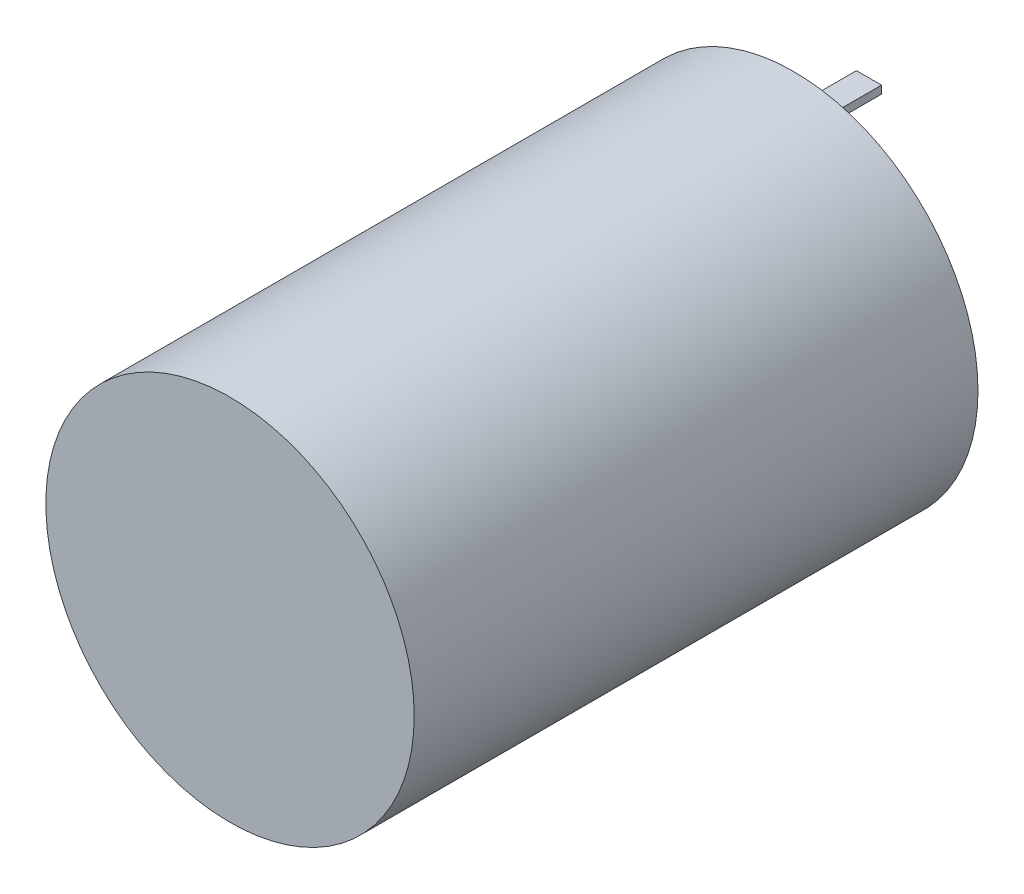
ISO-10303-21;
HEADER;
FILE_DESCRIPTION(('STEP AP214'),'2;1');
FILE_NAME('part.step','',(''),(''),'','','');
FILE_SCHEMA(('AUTOMOTIVE_DESIGN { 1 0 10303 214 1 1 1 1 }'));
ENDSEC;
DATA;
#1=APPLICATION_CONTEXT('core data for automotive mechanical design processes');
#2=APPLICATION_PROTOCOL_DEFINITION('international standard','automotive_design',2000,#1);
#3=PRODUCT_CONTEXT('',#1,'mechanical');
#4=PRODUCT('Part','Part','',(#3));
#5=PRODUCT_RELATED_PRODUCT_CATEGORY('part','',(#4));
#6=PRODUCT_DEFINITION_FORMATION('','',#4);
#7=PRODUCT_DEFINITION_CONTEXT('part definition',#1,'design');
#8=PRODUCT_DEFINITION('design','',#6,#7);
#9=PRODUCT_DEFINITION_SHAPE('','',#8);
#10=(LENGTH_UNIT() NAMED_UNIT(*) SI_UNIT(.MILLI.,.METRE.));
#11=(NAMED_UNIT(*) PLANE_ANGLE_UNIT() SI_UNIT($,.RADIAN.));
#12=(NAMED_UNIT(*) SI_UNIT($,.STERADIAN.) SOLID_ANGLE_UNIT());
#13=UNCERTAINTY_MEASURE_WITH_UNIT(LENGTH_MEASURE(1.E-05),#10,'distance_accuracy_value','');
#14=(GEOMETRIC_REPRESENTATION_CONTEXT(3) GLOBAL_UNCERTAINTY_ASSIGNED_CONTEXT((#13)) GLOBAL_UNIT_ASSIGNED_CONTEXT((#10,
#11,#12)) REPRESENTATION_CONTEXT('',''));
#15=CARTESIAN_POINT('',(0.,0.,0.));
#16=DIRECTION('',(0.,0.,1.));
#17=DIRECTION('',(1.,0.,0.));
#18=AXIS2_PLACEMENT_3D('',#15,#16,#17);
#19=CARTESIAN_POINT('',(0.,0.,57.15));
#20=DIRECTION('',(0.,0.,-1.));
#21=DIRECTION('',(-1.,0.,0.));
#22=AXIS2_PLACEMENT_3D('',#19,#20,#21);
#23=CYLINDRICAL_SURFACE('',#22,18.669);
#24=CARTESIAN_POINT('',(0.,0.,57.15));
#25=DIRECTION('',(0.,0.,1.));
#26=DIRECTION('',(1.,0.,0.));
#27=AXIS2_PLACEMENT_3D('',#24,#25,#26);
#28=CIRCLE('',#27,18.669);
#29=CARTESIAN_POINT('',(18.669,0.,57.15));
#30=VERTEX_POINT('',#29);
#31=EDGE_CURVE('E11',#30,#30,#28,.T.);
#32=ORIENTED_EDGE('',*,*,#31,.F.);
#33=EDGE_LOOP('',(#32));
#34=FACE_BOUND('',#33,.T.);
#35=CARTESIAN_POINT('',(0.,0.,0.));
#36=DIRECTION('',(0.,0.,1.));
#37=DIRECTION('',(1.,0.,0.));
#38=AXIS2_PLACEMENT_3D('',#35,#36,#37);
#39=CIRCLE('',#38,18.669);
#40=CARTESIAN_POINT('',(18.669,0.,0.));
#41=VERTEX_POINT('',#40);
#42=EDGE_CURVE('E37',#41,#41,#39,.T.);
#43=ORIENTED_EDGE('',*,*,#42,.T.);
#44=EDGE_LOOP('',(#43));
#45=FACE_BOUND('',#44,.T.);
#46=ADVANCED_FACE('F34',(#34,#45),#23,.T.);
#47=CARTESIAN_POINT('',(0.,0.,57.15));
#48=DIRECTION('',(0.,0.,1.));
#49=DIRECTION('',(1.,0.,0.));
#50=AXIS2_PLACEMENT_3D('',#47,#48,#49);
#51=PLANE('',#50);
#52=ORIENTED_EDGE('',*,*,#31,.T.);
#53=EDGE_LOOP('',(#52));
#54=FACE_BOUND('',#53,.T.);
#55=ADVANCED_FACE('F175',(#54),#51,.T.);
#56=CARTESIAN_POINT('',(0.,0.,0.));
#57=DIRECTION('',(0.,0.,1.));
#58=DIRECTION('',(1.,0.,0.));
#59=AXIS2_PLACEMENT_3D('',#56,#57,#58);
#60=PLANE('',#59);
#61=DIRECTION('',(-1.,0.,0.));
#62=VECTOR('',#61,1.);
#63=CARTESIAN_POINT('',(0.,-13.509625,0.));
#64=LINE('',#63,#62);
#65=CARTESIAN_POINT('',(1.27,-13.509625,0.));
#66=VERTEX_POINT('',#65);
#67=CARTESIAN_POINT('',(-1.27,-13.509625,0.));
#68=VERTEX_POINT('',#67);
#69=EDGE_CURVE('E48',#66,#68,#64,.T.);
#70=ORIENTED_EDGE('',*,*,#69,.T.);
#71=DIRECTION('',(0.,-1.,0.));
#72=VECTOR('',#71,1.);
#73=CARTESIAN_POINT('',(-1.26999999999999,0.,0.));
#74=LINE('',#73,#72);
#75=CARTESIAN_POINT('',(-1.27,-14.303375,0.));
#76=VERTEX_POINT('',#75);
#77=EDGE_CURVE('E102',#68,#76,#74,.T.);
#78=ORIENTED_EDGE('',*,*,#77,.T.);
#79=DIRECTION('',(-1.,0.,0.));
#80=VECTOR('',#79,1.);
#81=CARTESIAN_POINT('',(0.,-14.303375,0.));
#82=LINE('',#81,#80);
#83=CARTESIAN_POINT('',(1.27,-14.303375,0.));
#84=VERTEX_POINT('',#83);
#85=EDGE_CURVE('E115',#84,#76,#82,.T.);
#86=ORIENTED_EDGE('',*,*,#85,.F.);
#87=DIRECTION('',(0.,-1.,0.));
#88=VECTOR('',#87,1.);
#89=CARTESIAN_POINT('',(1.27,0.,0.));
#90=LINE('',#89,#88);
#91=EDGE_CURVE('E53',#66,#84,#90,.T.);
#92=ORIENTED_EDGE('',*,*,#91,.F.);
#93=EDGE_LOOP('',(#70,#78,#86,#92));
#94=FACE_BOUND('',#93,.T.);
#95=DIRECTION('',(-1.,0.,0.));
#96=VECTOR('',#95,1.);
#97=CARTESIAN_POINT('',(0.,14.303375,0.));
#98=LINE('',#97,#96);
#99=CARTESIAN_POINT('',(1.27,14.303375,0.));
#100=VERTEX_POINT('',#99);
#101=CARTESIAN_POINT('',(-1.27,14.303375,0.));
#102=VERTEX_POINT('',#101);
#103=EDGE_CURVE('E148',#100,#102,#98,.T.);
#104=ORIENTED_EDGE('',*,*,#103,.T.);
#105=DIRECTION('',(0.,-1.,0.));
#106=VECTOR('',#105,1.);
#107=CARTESIAN_POINT('',(-1.27,0.,0.));
#108=LINE('',#107,#106);
#109=CARTESIAN_POINT('',(-1.27,13.509625,0.));
#110=VERTEX_POINT('',#109);
#111=EDGE_CURVE('E105',#102,#110,#108,.T.);
#112=ORIENTED_EDGE('',*,*,#111,.T.);
#113=DIRECTION('',(-1.,0.,0.));
#114=VECTOR('',#113,1.);
#115=CARTESIAN_POINT('',(0.,13.509625,0.));
#116=LINE('',#115,#114);
#117=CARTESIAN_POINT('',(1.27,13.509625,0.));
#118=VERTEX_POINT('',#117);
#119=EDGE_CURVE('E139',#118,#110,#116,.T.);
#120=ORIENTED_EDGE('',*,*,#119,.F.);
#121=DIRECTION('',(0.,-1.,0.));
#122=VECTOR('',#121,1.);
#123=CARTESIAN_POINT('',(1.27,0.,0.));
#124=LINE('',#123,#122);
#125=EDGE_CURVE('E150',#100,#118,#124,.T.);
#126=ORIENTED_EDGE('',*,*,#125,.F.);
#127=EDGE_LOOP('',(#104,#112,#120,#126));
#128=FACE_BOUND('',#127,.T.);
#129=ORIENTED_EDGE('',*,*,#42,.F.);
#130=EDGE_LOOP('',(#129));
#131=FACE_BOUND('',#130,.T.);
#132=ADVANCED_FACE('F172',(#94,#128,#131),#60,.F.);
#133=CARTESIAN_POINT('',(-1.27,0.,-7.62));
#134=DIRECTION('',(-1.,0.,0.));
#135=DIRECTION('',(0.,0.,1.));
#136=AXIS2_PLACEMENT_3D('',#133,#134,#135);
#137=PLANE('',#136);
#138=ORIENTED_EDGE('',*,*,#111,.F.);
#139=DIRECTION('',(0.,0.,1.));
#140=VECTOR('',#139,1.);
#141=CARTESIAN_POINT('',(-1.27,14.303375,-7.62));
#142=LINE('',#141,#140);
#143=CARTESIAN_POINT('',(-1.27,14.303375,-7.62));
#144=VERTEX_POINT('',#143);
#145=EDGE_CURVE('E163',#144,#102,#142,.T.);
#146=ORIENTED_EDGE('',*,*,#145,.F.);
#147=DIRECTION('',(0.,-1.,0.));
#148=VECTOR('',#147,1.);
#149=CARTESIAN_POINT('',(-1.27,0.,-7.62));
#150=LINE('',#149,#148);
#151=CARTESIAN_POINT('',(-1.27,13.509625,-7.62));
#152=VERTEX_POINT('',#151);
#153=EDGE_CURVE('E135',#144,#152,#150,.T.);
#154=ORIENTED_EDGE('',*,*,#153,.T.);
#155=DIRECTION('',(0.,0.,1.));
#156=VECTOR('',#155,1.);
#157=CARTESIAN_POINT('',(-1.27,13.509625,-7.62));
#158=LINE('',#157,#156);
#159=EDGE_CURVE('E146',#152,#110,#158,.T.);
#160=ORIENTED_EDGE('',*,*,#159,.T.);
#161=EDGE_LOOP('',(#138,#146,#154,#160));
#162=FACE_BOUND('',#161,.T.);
#163=ADVANCED_FACE('F174',(#162),#137,.T.);
#164=CARTESIAN_POINT('',(0.,14.303375,-7.62));
#165=DIRECTION('',(0.,1.,0.));
#166=DIRECTION('',(0.,0.,1.));
#167=AXIS2_PLACEMENT_3D('',#164,#165,#166);
#168=PLANE('',#167);
#169=ORIENTED_EDGE('',*,*,#103,.F.);
#170=DIRECTION('',(0.,0.,1.));
#171=VECTOR('',#170,1.);
#172=CARTESIAN_POINT('',(1.27,14.303375,-7.62));
#173=LINE('',#172,#171);
#174=CARTESIAN_POINT('',(1.27,14.303375,-7.62));
#175=VERTEX_POINT('',#174);
#176=EDGE_CURVE('E160',#175,#100,#173,.T.);
#177=ORIENTED_EDGE('',*,*,#176,.F.);
#178=DIRECTION('',(-1.,0.,0.));
#179=VECTOR('',#178,1.);
#180=CARTESIAN_POINT('',(0.,14.303375,-7.62));
#181=LINE('',#180,#179);
#182=EDGE_CURVE('E138',#175,#144,#181,.T.);
#183=ORIENTED_EDGE('',*,*,#182,.T.);
#184=ORIENTED_EDGE('',*,*,#145,.T.);
#185=EDGE_LOOP('',(#169,#177,#183,#184));
#186=FACE_BOUND('',#185,.T.);
#187=ADVANCED_FACE('F180',(#186),#168,.T.);
#188=CARTESIAN_POINT('',(1.27,0.,-7.62));
#189=DIRECTION('',(-1.,0.,0.));
#190=DIRECTION('',(0.,0.,1.));
#191=AXIS2_PLACEMENT_3D('',#188,#189,#190);
#192=PLANE('',#191);
#193=ORIENTED_EDGE('',*,*,#125,.T.);
#194=DIRECTION('',(0.,0.,1.));
#195=VECTOR('',#194,1.);
#196=CARTESIAN_POINT('',(1.27,13.509625,-7.62));
#197=LINE('',#196,#195);
#198=CARTESIAN_POINT('',(1.27,13.509625,-7.62));
#199=VERTEX_POINT('',#198);
#200=EDGE_CURVE('E157',#199,#118,#197,.T.);
#201=ORIENTED_EDGE('',*,*,#200,.F.);
#202=DIRECTION('',(0.,-1.,0.));
#203=VECTOR('',#202,1.);
#204=CARTESIAN_POINT('',(1.27,0.,-7.62));
#205=LINE('',#204,#203);
#206=EDGE_CURVE('E142',#175,#199,#205,.T.);
#207=ORIENTED_EDGE('',*,*,#206,.F.);
#208=ORIENTED_EDGE('',*,*,#176,.T.);
#209=EDGE_LOOP('',(#193,#201,#207,#208));
#210=FACE_BOUND('',#209,.T.);
#211=ADVANCED_FACE('F214',(#210),#192,.F.);
#212=CARTESIAN_POINT('',(0.,13.509625,-7.62));
#213=DIRECTION('',(0.,1.,0.));
#214=DIRECTION('',(0.,0.,1.));
#215=AXIS2_PLACEMENT_3D('',#212,#213,#214);
#216=PLANE('',#215);
#217=ORIENTED_EDGE('',*,*,#119,.T.);
#218=ORIENTED_EDGE('',*,*,#159,.F.);
#219=DIRECTION('',(-1.,0.,0.));
#220=VECTOR('',#219,1.);
#221=CARTESIAN_POINT('',(0.,13.509625,-7.62));
#222=LINE('',#221,#220);
#223=EDGE_CURVE('E144',#199,#152,#222,.T.);
#224=ORIENTED_EDGE('',*,*,#223,.F.);
#225=ORIENTED_EDGE('',*,*,#200,.T.);
#226=EDGE_LOOP('',(#217,#218,#224,#225));
#227=FACE_BOUND('',#226,.T.);
#228=ADVANCED_FACE('F223',(#227),#216,.F.);
#229=CARTESIAN_POINT('',(0.,0.,-7.62));
#230=DIRECTION('',(0.,0.,-1.));
#231=DIRECTION('',(-1.,0.,0.));
#232=AXIS2_PLACEMENT_3D('',#229,#230,#231);
#233=PLANE('',#232);
#234=ORIENTED_EDGE('',*,*,#153,.F.);
#235=ORIENTED_EDGE('',*,*,#182,.F.);
#236=ORIENTED_EDGE('',*,*,#206,.T.);
#237=ORIENTED_EDGE('',*,*,#223,.T.);
#238=EDGE_LOOP('',(#234,#235,#236,#237));
#239=FACE_BOUND('',#238,.T.);
#240=ADVANCED_FACE('F233',(#239),#233,.T.);
#241=CARTESIAN_POINT('',(-1.26999999999999,0.,-7.62));
#242=DIRECTION('',(-1.,0.,0.));
#243=DIRECTION('',(0.,-1.,0.));
#244=AXIS2_PLACEMENT_3D('',#241,#242,#243);
#245=PLANE('',#244);
#246=ORIENTED_EDGE('',*,*,#77,.F.);
#247=DIRECTION('',(0.,0.,1.));
#248=VECTOR('',#247,1.);
#249=CARTESIAN_POINT('',(-1.27,-13.509625,-7.62));
#250=LINE('',#249,#248);
#251=CARTESIAN_POINT('',(-1.27,-13.509625,-7.62));
#252=VERTEX_POINT('',#251);
#253=EDGE_CURVE('E97',#252,#68,#250,.T.);
#254=ORIENTED_EDGE('',*,*,#253,.F.);
#255=DIRECTION('',(0.,-1.,0.));
#256=VECTOR('',#255,1.);
#257=CARTESIAN_POINT('',(-1.26999999999999,0.,-7.62));
#258=LINE('',#257,#256);
#259=CARTESIAN_POINT('',(-1.27,-14.303375,-7.62));
#260=VERTEX_POINT('',#259);
#261=EDGE_CURVE('E101',#252,#260,#258,.T.);
#262=ORIENTED_EDGE('',*,*,#261,.T.);
#263=DIRECTION('',(0.,0.,1.));
#264=VECTOR('',#263,1.);
#265=CARTESIAN_POINT('',(-1.27,-14.303375,-7.62));
#266=LINE('',#265,#264);
#267=EDGE_CURVE('E124',#260,#76,#266,.T.);
#268=ORIENTED_EDGE('',*,*,#267,.T.);
#269=EDGE_LOOP('',(#246,#254,#262,#268));
#270=FACE_BOUND('',#269,.T.);
#271=ADVANCED_FACE('F99',(#270),#245,.T.);
#272=CARTESIAN_POINT('',(0.,-13.509625,-7.62));
#273=DIRECTION('',(0.,1.,0.));
#274=DIRECTION('',(0.,0.,1.));
#275=AXIS2_PLACEMENT_3D('',#272,#273,#274);
#276=PLANE('',#275);
#277=ORIENTED_EDGE('',*,*,#69,.F.);
#278=DIRECTION('',(0.,0.,1.));
#279=VECTOR('',#278,1.);
#280=CARTESIAN_POINT('',(1.27,-13.509625,-7.62));
#281=LINE('',#280,#279);
#282=CARTESIAN_POINT('',(1.27,-13.509625,-7.62));
#283=VERTEX_POINT('',#282);
#284=EDGE_CURVE('E106',#283,#66,#281,.T.);
#285=ORIENTED_EDGE('',*,*,#284,.F.);
#286=DIRECTION('',(-1.,0.,0.));
#287=VECTOR('',#286,1.);
#288=CARTESIAN_POINT('',(0.,-13.509625,-7.62));
#289=LINE('',#288,#287);
#290=EDGE_CURVE('E111',#283,#252,#289,.T.);
#291=ORIENTED_EDGE('',*,*,#290,.T.);
#292=ORIENTED_EDGE('',*,*,#253,.T.);
#293=EDGE_LOOP('',(#277,#285,#291,#292));
#294=FACE_BOUND('',#293,.T.);
#295=ADVANCED_FACE('F117',(#294),#276,.T.);
#296=CARTESIAN_POINT('',(1.27,0.,-7.62));
#297=DIRECTION('',(-1.,0.,0.));
#298=DIRECTION('',(0.,0.,1.));
#299=AXIS2_PLACEMENT_3D('',#296,#297,#298);
#300=PLANE('',#299);
#301=ORIENTED_EDGE('',*,*,#91,.T.);
#302=DIRECTION('',(0.,0.,1.));
#303=VECTOR('',#302,1.);
#304=CARTESIAN_POINT('',(1.27,-14.303375,-7.62));
#305=LINE('',#304,#303);
#306=CARTESIAN_POINT('',(1.27,-14.303375,-7.62));
#307=VERTEX_POINT('',#306);
#308=EDGE_CURVE('E131',#307,#84,#305,.T.);
#309=ORIENTED_EDGE('',*,*,#308,.F.);
#310=DIRECTION('',(0.,-1.,0.));
#311=VECTOR('',#310,1.);
#312=CARTESIAN_POINT('',(1.27,0.,-7.62));
#313=LINE('',#312,#311);
#314=EDGE_CURVE('E119',#283,#307,#313,.T.);
#315=ORIENTED_EDGE('',*,*,#314,.F.);
#316=ORIENTED_EDGE('',*,*,#284,.T.);
#317=EDGE_LOOP('',(#301,#309,#315,#316));
#318=FACE_BOUND('',#317,.T.);
#319=ADVANCED_FACE('F260',(#318),#300,.F.);
#320=CARTESIAN_POINT('',(0.,-14.303375,-7.62));
#321=DIRECTION('',(0.,1.,0.));
#322=DIRECTION('',(0.,0.,1.));
#323=AXIS2_PLACEMENT_3D('',#320,#321,#322);
#324=PLANE('',#323);
#325=ORIENTED_EDGE('',*,*,#85,.T.);
#326=ORIENTED_EDGE('',*,*,#267,.F.);
#327=DIRECTION('',(-1.,0.,0.));
#328=VECTOR('',#327,1.);
#329=CARTESIAN_POINT('',(0.,-14.303375,-7.62));
#330=LINE('',#329,#328);
#331=EDGE_CURVE('E113',#307,#260,#330,.T.);
#332=ORIENTED_EDGE('',*,*,#331,.F.);
#333=ORIENTED_EDGE('',*,*,#308,.T.);
#334=EDGE_LOOP('',(#325,#326,#332,#333));
#335=FACE_BOUND('',#334,.T.);
#336=ADVANCED_FACE('F269',(#335),#324,.F.);
#337=CARTESIAN_POINT('',(0.,0.,-7.62));
#338=DIRECTION('',(0.,0.,-1.));
#339=DIRECTION('',(-1.,0.,0.));
#340=AXIS2_PLACEMENT_3D('',#337,#338,#339);
#341=PLANE('',#340);
#342=ORIENTED_EDGE('',*,*,#261,.F.);
#343=ORIENTED_EDGE('',*,*,#290,.F.);
#344=ORIENTED_EDGE('',*,*,#314,.T.);
#345=ORIENTED_EDGE('',*,*,#331,.T.);
#346=EDGE_LOOP('',(#342,#343,#344,#345));
#347=FACE_BOUND('',#346,.T.);
#348=ADVANCED_FACE('F110',(#347),#341,.T.);
#349=CLOSED_SHELL('',(#46,#55,#132,#163,#187,#211,#228,#240,#271,#295,#319,#336,#348));
#350=MANIFOLD_SOLID_BREP('B2',#349);
#351=ADVANCED_BREP_SHAPE_REPRESENTATION('',(#18,#350),#14);
#352=SHAPE_DEFINITION_REPRESENTATION(#9,#351);
ENDSEC;
END-ISO-10303-21;
